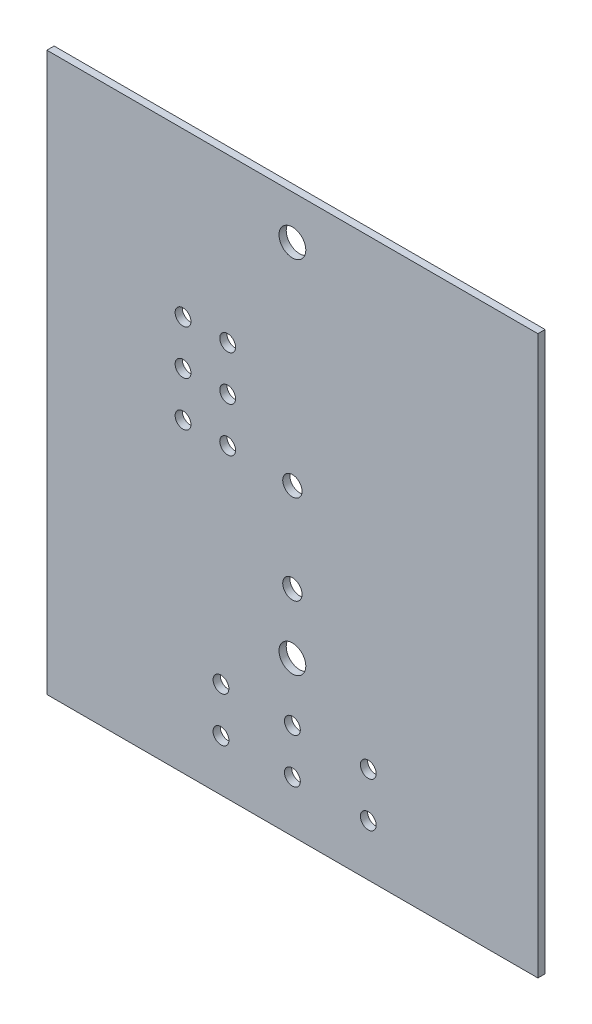
ISO-10303-21;
HEADER;
FILE_DESCRIPTION(('STEP AP214'),'2;1');
FILE_NAME('part.step','',(''),(''),'','','');
FILE_SCHEMA(('AUTOMOTIVE_DESIGN { 1 0 10303 214 1 1 1 1 }'));
ENDSEC;
DATA;
#1=APPLICATION_CONTEXT('core data for automotive mechanical design processes');
#2=APPLICATION_PROTOCOL_DEFINITION('international standard','automotive_design',2000,#1);
#3=PRODUCT_CONTEXT('',#1,'mechanical');
#4=PRODUCT('Part','Part','',(#3));
#5=PRODUCT_RELATED_PRODUCT_CATEGORY('part','',(#4));
#6=PRODUCT_DEFINITION_FORMATION('','',#4);
#7=PRODUCT_DEFINITION_CONTEXT('part definition',#1,'design');
#8=PRODUCT_DEFINITION('design','',#6,#7);
#9=PRODUCT_DEFINITION_SHAPE('','',#8);
#10=(LENGTH_UNIT() NAMED_UNIT(*) SI_UNIT(.MILLI.,.METRE.));
#11=(NAMED_UNIT(*) PLANE_ANGLE_UNIT() SI_UNIT($,.RADIAN.));
#12=(NAMED_UNIT(*) SI_UNIT($,.STERADIAN.) SOLID_ANGLE_UNIT());
#13=UNCERTAINTY_MEASURE_WITH_UNIT(LENGTH_MEASURE(1.E-05),#10,'distance_accuracy_value','');
#14=(GEOMETRIC_REPRESENTATION_CONTEXT(3) GLOBAL_UNCERTAINTY_ASSIGNED_CONTEXT((#13)) GLOBAL_UNIT_ASSIGNED_CONTEXT((#10,
#11,#12)) REPRESENTATION_CONTEXT('',''));
#15=CARTESIAN_POINT('',(0.,0.,0.));
#16=DIRECTION('',(0.,0.,1.));
#17=DIRECTION('',(1.,0.,0.));
#18=AXIS2_PLACEMENT_3D('',#15,#16,#17);
#19=CARTESIAN_POINT('',(0.,31.75,0.));
#20=DIRECTION('',(0.,0.,1.));
#21=DIRECTION('',(1.,0.,0.));
#22=AXIS2_PLACEMENT_3D('',#19,#20,#21);
#23=PLANE('',#22);
#24=CARTESIAN_POINT('',(13.97,29.2608,0.));
#25=DIRECTION('',(0.,0.,-1.));
#26=DIRECTION('',(-1.,0.,0.));
#27=AXIS2_PLACEMENT_3D('',#24,#25,#26);
#28=CIRCLE('',#27,0.762);
#29=CARTESIAN_POINT('',(13.208,29.2608,0.));
#30=VERTEX_POINT('',#29);
#31=EDGE_CURVE('E127',#30,#30,#28,.T.);
#32=ORIENTED_EDGE('',*,*,#31,.T.);
#33=EDGE_LOOP('',(#32));
#34=FACE_BOUND('',#33,.T.);
#35=CARTESIAN_POINT('',(13.97,8.763,0.));
#36=DIRECTION('',(0.,0.,-1.));
#37=DIRECTION('',(-1.,0.,0.));
#38=AXIS2_PLACEMENT_3D('',#35,#36,#37);
#39=CIRCLE('',#38,0.762);
#40=CARTESIAN_POINT('',(13.208,8.763,0.));
#41=VERTEX_POINT('',#40);
#42=EDGE_CURVE('E130',#41,#41,#39,.T.);
#43=ORIENTED_EDGE('',*,*,#42,.T.);
#44=EDGE_LOOP('',(#43));
#45=FACE_BOUND('',#44,.T.);
#46=CARTESIAN_POINT('',(13.97,17.272,0.));
#47=DIRECTION('',(0.,0.,-1.));
#48=DIRECTION('',(-1.,0.,0.));
#49=AXIS2_PLACEMENT_3D('',#46,#47,#48);
#50=CIRCLE('',#49,0.5499989);
#51=CARTESIAN_POINT('',(13.4200011,17.272,0.));
#52=VERTEX_POINT('',#51);
#53=EDGE_CURVE('E133',#52,#52,#50,.T.);
#54=ORIENTED_EDGE('',*,*,#53,.T.);
#55=EDGE_LOOP('',(#54));
#56=FACE_BOUND('',#55,.T.);
#57=CARTESIAN_POINT('',(13.97,12.192,0.));
#58=DIRECTION('',(0.,0.,-1.));
#59=DIRECTION('',(-1.,0.,0.));
#60=AXIS2_PLACEMENT_3D('',#57,#58,#59);
#61=CIRCLE('',#60,0.5499989);
#62=CARTESIAN_POINT('',(13.4200011,12.192,0.));
#63=VERTEX_POINT('',#62);
#64=EDGE_CURVE('E136',#63,#63,#61,.T.);
#65=ORIENTED_EDGE('',*,*,#64,.T.);
#66=EDGE_LOOP('',(#65));
#67=FACE_BOUND('',#66,.T.);
#68=CARTESIAN_POINT('',(18.288,5.461,0.));
#69=DIRECTION('',(0.,0.,-1.));
#70=DIRECTION('',(-1.,0.,0.));
#71=AXIS2_PLACEMENT_3D('',#68,#69,#70);
#72=CIRCLE('',#71,0.4499991);
#73=CARTESIAN_POINT('',(17.8380009,5.461,0.));
#74=VERTEX_POINT('',#73);
#75=EDGE_CURVE('E139',#74,#74,#72,.T.);
#76=ORIENTED_EDGE('',*,*,#75,.T.);
#77=EDGE_LOOP('',(#76));
#78=FACE_BOUND('',#77,.T.);
#79=CARTESIAN_POINT('',(18.288,2.921,0.));
#80=DIRECTION('',(0.,0.,-1.));
#81=DIRECTION('',(-1.,0.,0.));
#82=AXIS2_PLACEMENT_3D('',#79,#80,#81);
#83=CIRCLE('',#82,0.4499991);
#84=CARTESIAN_POINT('',(17.8380009,2.921,0.));
#85=VERTEX_POINT('',#84);
#86=EDGE_CURVE('E142',#85,#85,#83,.T.);
#87=ORIENTED_EDGE('',*,*,#86,.T.);
#88=EDGE_LOOP('',(#87));
#89=FACE_BOUND('',#88,.T.);
#90=CARTESIAN_POINT('',(13.97,5.461,0.));
#91=DIRECTION('',(0.,0.,-1.));
#92=DIRECTION('',(-1.,0.,0.));
#93=AXIS2_PLACEMENT_3D('',#90,#91,#92);
#94=CIRCLE('',#93,0.4499991);
#95=CARTESIAN_POINT('',(13.5200009,5.461,0.));
#96=VERTEX_POINT('',#95);
#97=EDGE_CURVE('E145',#96,#96,#94,.T.);
#98=ORIENTED_EDGE('',*,*,#97,.T.);
#99=EDGE_LOOP('',(#98));
#100=FACE_BOUND('',#99,.T.);
#101=CARTESIAN_POINT('',(13.97,2.921,0.));
#102=DIRECTION('',(0.,0.,-1.));
#103=DIRECTION('',(-1.,0.,0.));
#104=AXIS2_PLACEMENT_3D('',#101,#102,#103);
#105=CIRCLE('',#104,0.4499991);
#106=CARTESIAN_POINT('',(13.5200009,2.921,0.));
#107=VERTEX_POINT('',#106);
#108=EDGE_CURVE('E148',#107,#107,#105,.T.);
#109=ORIENTED_EDGE('',*,*,#108,.T.);
#110=EDGE_LOOP('',(#109));
#111=FACE_BOUND('',#110,.T.);
#112=CARTESIAN_POINT('',(10.287,22.479,0.));
#113=DIRECTION('',(0.,0.,-1.));
#114=DIRECTION('',(-1.,0.,0.));
#115=AXIS2_PLACEMENT_3D('',#112,#113,#114);
#116=CIRCLE('',#115,0.4499991);
#117=CARTESIAN_POINT('',(9.8370009,22.479,0.));
#118=VERTEX_POINT('',#117);
#119=EDGE_CURVE('E151',#118,#118,#116,.T.);
#120=ORIENTED_EDGE('',*,*,#119,.T.);
#121=EDGE_LOOP('',(#120));
#122=FACE_BOUND('',#121,.T.);
#123=CARTESIAN_POINT('',(10.287,19.939,0.));
#124=DIRECTION('',(0.,0.,-1.));
#125=DIRECTION('',(-1.,0.,0.));
#126=AXIS2_PLACEMENT_3D('',#123,#124,#125);
#127=CIRCLE('',#126,0.4499991);
#128=CARTESIAN_POINT('',(9.8370009,19.939,0.));
#129=VERTEX_POINT('',#128);
#130=EDGE_CURVE('E154',#129,#129,#127,.T.);
#131=ORIENTED_EDGE('',*,*,#130,.T.);
#132=EDGE_LOOP('',(#131));
#133=FACE_BOUND('',#132,.T.);
#134=CARTESIAN_POINT('',(7.747,22.479,0.));
#135=DIRECTION('',(0.,0.,-1.));
#136=DIRECTION('',(-1.,0.,0.));
#137=AXIS2_PLACEMENT_3D('',#134,#135,#136);
#138=CIRCLE('',#137,0.4499991);
#139=CARTESIAN_POINT('',(7.2970009,22.479,0.));
#140=VERTEX_POINT('',#139);
#141=EDGE_CURVE('E157',#140,#140,#138,.T.);
#142=ORIENTED_EDGE('',*,*,#141,.T.);
#143=EDGE_LOOP('',(#142));
#144=FACE_BOUND('',#143,.T.);
#145=CARTESIAN_POINT('',(7.747,19.939,0.));
#146=DIRECTION('',(0.,0.,-1.));
#147=DIRECTION('',(-1.,0.,0.));
#148=AXIS2_PLACEMENT_3D('',#145,#146,#147);
#149=CIRCLE('',#148,0.4499991);
#150=CARTESIAN_POINT('',(7.2970009,19.939,0.));
#151=VERTEX_POINT('',#150);
#152=EDGE_CURVE('E160',#151,#151,#149,.T.);
#153=ORIENTED_EDGE('',*,*,#152,.T.);
#154=EDGE_LOOP('',(#153));
#155=FACE_BOUND('',#154,.T.);
#156=CARTESIAN_POINT('',(10.287,17.399,0.));
#157=DIRECTION('',(0.,0.,-1.));
#158=DIRECTION('',(-1.,0.,0.));
#159=AXIS2_PLACEMENT_3D('',#156,#157,#158);
#160=CIRCLE('',#159,0.4499991);
#161=CARTESIAN_POINT('',(9.8370009,17.399,0.));
#162=VERTEX_POINT('',#161);
#163=EDGE_CURVE('E163',#162,#162,#160,.T.);
#164=ORIENTED_EDGE('',*,*,#163,.T.);
#165=EDGE_LOOP('',(#164));
#166=FACE_BOUND('',#165,.T.);
#167=CARTESIAN_POINT('',(9.906,5.461,0.));
#168=DIRECTION('',(0.,0.,-1.));
#169=DIRECTION('',(-1.,0.,0.));
#170=AXIS2_PLACEMENT_3D('',#167,#168,#169);
#171=CIRCLE('',#170,0.4499991);
#172=CARTESIAN_POINT('',(9.4560009,5.461,0.));
#173=VERTEX_POINT('',#172);
#174=EDGE_CURVE('E166',#173,#173,#171,.T.);
#175=ORIENTED_EDGE('',*,*,#174,.T.);
#176=EDGE_LOOP('',(#175));
#177=FACE_BOUND('',#176,.T.);
#178=CARTESIAN_POINT('',(7.747,17.399,0.));
#179=DIRECTION('',(0.,0.,-1.));
#180=DIRECTION('',(-1.,0.,0.));
#181=AXIS2_PLACEMENT_3D('',#178,#179,#180);
#182=CIRCLE('',#181,0.4499991);
#183=CARTESIAN_POINT('',(7.2970009,17.399,0.));
#184=VERTEX_POINT('',#183);
#185=EDGE_CURVE('E168',#184,#184,#182,.T.);
#186=ORIENTED_EDGE('',*,*,#185,.T.);
#187=EDGE_LOOP('',(#186));
#188=FACE_BOUND('',#187,.T.);
#189=CARTESIAN_POINT('',(9.906,2.921,0.));
#190=DIRECTION('',(0.,0.,-1.));
#191=DIRECTION('',(-1.,0.,0.));
#192=AXIS2_PLACEMENT_3D('',#189,#190,#191);
#193=CIRCLE('',#192,0.4499991);
#194=CARTESIAN_POINT('',(9.4560009,2.921,0.));
#195=VERTEX_POINT('',#194);
#196=EDGE_CURVE('E19',#195,#195,#193,.T.);
#197=ORIENTED_EDGE('',*,*,#196,.T.);
#198=EDGE_LOOP('',(#197));
#199=FACE_BOUND('',#198,.T.);
#200=DIRECTION('',(0.,1.,0.));
#201=VECTOR('',#200,1.);
#202=CARTESIAN_POINT('',(27.940000534058,31.75,0.));
#203=LINE('',#202,#201);
#204=CARTESIAN_POINT('',(27.940000534058,31.75,0.));
#205=VERTEX_POINT('',#204);
#206=CARTESIAN_POINT('',(27.940000534058,0.,0.));
#207=VERTEX_POINT('',#206);
#208=EDGE_CURVE('E53',#205,#207,#203,.F.);
#209=ORIENTED_EDGE('',*,*,#208,.F.);
#210=DIRECTION('',(1.,0.,0.));
#211=VECTOR('',#210,1.);
#212=CARTESIAN_POINT('',(0.,31.75,0.));
#213=LINE('',#212,#211);
#214=CARTESIAN_POINT('',(0.,31.75,0.));
#215=VERTEX_POINT('',#214);
#216=EDGE_CURVE('E70',#215,#205,#213,.T.);
#217=ORIENTED_EDGE('',*,*,#216,.F.);
#218=DIRECTION('',(0.,1.,0.));
#219=VECTOR('',#218,1.);
#220=CARTESIAN_POINT('',(0.,0.,0.));
#221=LINE('',#220,#219);
#222=CARTESIAN_POINT('',(0.,0.,0.));
#223=VERTEX_POINT('',#222);
#224=EDGE_CURVE('E67',#223,#215,#221,.T.);
#225=ORIENTED_EDGE('',*,*,#224,.F.);
#226=DIRECTION('',(1.,0.,0.));
#227=VECTOR('',#226,1.);
#228=CARTESIAN_POINT('',(27.940000534058,0.,0.));
#229=LINE('',#228,#227);
#230=EDGE_CURVE('E58',#207,#223,#229,.F.);
#231=ORIENTED_EDGE('',*,*,#230,.F.);
#232=EDGE_LOOP('',(#209,#217,#225,#231));
#233=FACE_BOUND('',#232,.T.);
#234=ADVANCED_FACE('F16',(#34,#45,#56,#67,#78,#89,#100,#111,#122,#133,#144,#155,#166,#177,#188,
#199,#233),#23,.T.);
#235=CARTESIAN_POINT('',(0.,0.,-0.41148));
#236=DIRECTION('',(-1.,0.,0.));
#237=DIRECTION('',(0.,0.,1.));
#238=AXIS2_PLACEMENT_3D('',#235,#236,#237);
#239=PLANE('',#238);
#240=DIRECTION('',(0.,0.,1.));
#241=VECTOR('',#240,1.);
#242=CARTESIAN_POINT('',(0.,31.75,-0.41148));
#243=LINE('',#242,#241);
#244=CARTESIAN_POINT('',(0.,31.75,-0.41148));
#245=VERTEX_POINT('',#244);
#246=EDGE_CURVE('E176',#245,#215,#243,.T.);
#247=ORIENTED_EDGE('',*,*,#246,.F.);
#248=DIRECTION('',(0.,1.,0.));
#249=VECTOR('',#248,1.);
#250=CARTESIAN_POINT('',(0.,31.75,-0.41148));
#251=LINE('',#250,#249);
#252=CARTESIAN_POINT('',(0.,0.,-0.41148));
#253=VERTEX_POINT('',#252);
#254=EDGE_CURVE('E77',#245,#253,#251,.F.);
#255=ORIENTED_EDGE('',*,*,#254,.T.);
#256=DIRECTION('',(0.,0.,-1.));
#257=VECTOR('',#256,1.);
#258=CARTESIAN_POINT('',(0.,0.,-0.41148));
#259=LINE('',#258,#257);
#260=EDGE_CURVE('E63',#223,#253,#259,.T.);
#261=ORIENTED_EDGE('',*,*,#260,.F.);
#262=ORIENTED_EDGE('',*,*,#224,.T.);
#263=EDGE_LOOP('',(#247,#255,#261,#262));
#264=FACE_BOUND('',#263,.T.);
#265=ADVANCED_FACE('F76',(#264),#239,.T.);
#266=CARTESIAN_POINT('',(27.940000534058,0.,-0.41148));
#267=DIRECTION('',(0.,-1.,0.));
#268=DIRECTION('',(0.,0.,-1.));
#269=AXIS2_PLACEMENT_3D('',#266,#267,#268);
#270=PLANE('',#269);
#271=ORIENTED_EDGE('',*,*,#260,.T.);
#272=DIRECTION('',(1.,0.,0.));
#273=VECTOR('',#272,1.);
#274=CARTESIAN_POINT('',(0.,0.,-0.41148));
#275=LINE('',#274,#273);
#276=CARTESIAN_POINT('',(27.940000534058,0.,-0.41148));
#277=VERTEX_POINT('',#276);
#278=EDGE_CURVE('E187',#253,#277,#275,.T.);
#279=ORIENTED_EDGE('',*,*,#278,.T.);
#280=DIRECTION('',(0.,0.,-1.));
#281=VECTOR('',#280,1.);
#282=CARTESIAN_POINT('',(27.940000534058,0.,-0.41148));
#283=LINE('',#282,#281);
#284=EDGE_CURVE('E65',#207,#277,#283,.T.);
#285=ORIENTED_EDGE('',*,*,#284,.F.);
#286=ORIENTED_EDGE('',*,*,#230,.T.);
#287=EDGE_LOOP('',(#271,#279,#285,#286));
#288=FACE_BOUND('',#287,.T.);
#289=ADVANCED_FACE('F60',(#288),#270,.T.);
#290=CARTESIAN_POINT('',(27.940000534058,31.75,-0.41148));
#291=DIRECTION('',(1.,0.,0.));
#292=DIRECTION('',(0.,0.,-1.));
#293=AXIS2_PLACEMENT_3D('',#290,#291,#292);
#294=PLANE('',#293);
#295=ORIENTED_EDGE('',*,*,#284,.T.);
#296=DIRECTION('',(0.,1.,0.));
#297=VECTOR('',#296,1.);
#298=CARTESIAN_POINT('',(27.940000534058,31.75,-0.41148));
#299=LINE('',#298,#297);
#300=CARTESIAN_POINT('',(27.940000534058,31.75,-0.41148));
#301=VERTEX_POINT('',#300);
#302=EDGE_CURVE('E184',#277,#301,#299,.T.);
#303=ORIENTED_EDGE('',*,*,#302,.T.);
#304=DIRECTION('',(0.,0.,1.));
#305=VECTOR('',#304,1.);
#306=CARTESIAN_POINT('',(27.940000534058,31.75,-0.41148));
#307=LINE('',#306,#305);
#308=EDGE_CURVE('E34',#205,#301,#307,.F.);
#309=ORIENTED_EDGE('',*,*,#308,.F.);
#310=ORIENTED_EDGE('',*,*,#208,.T.);
#311=EDGE_LOOP('',(#295,#303,#309,#310));
#312=FACE_BOUND('',#311,.T.);
#313=ADVANCED_FACE('F183',(#312),#294,.T.);
#314=CARTESIAN_POINT('',(0.,31.75,-0.41148));
#315=DIRECTION('',(0.,1.,0.));
#316=DIRECTION('',(0.,0.,1.));
#317=AXIS2_PLACEMENT_3D('',#314,#315,#316);
#318=PLANE('',#317);
#319=ORIENTED_EDGE('',*,*,#308,.T.);
#320=DIRECTION('',(1.,0.,0.));
#321=VECTOR('',#320,1.);
#322=CARTESIAN_POINT('',(0.,31.75,-0.41148));
#323=LINE('',#322,#321);
#324=EDGE_CURVE('E126',#301,#245,#323,.F.);
#325=ORIENTED_EDGE('',*,*,#324,.T.);
#326=ORIENTED_EDGE('',*,*,#246,.T.);
#327=ORIENTED_EDGE('',*,*,#216,.T.);
#328=EDGE_LOOP('',(#319,#325,#326,#327));
#329=FACE_BOUND('',#328,.T.);
#330=ADVANCED_FACE('F190',(#329),#318,.T.);
#331=CARTESIAN_POINT('',(9.906,2.921,-0.41148));
#332=DIRECTION('',(0.,0.,-1.));
#333=DIRECTION('',(-1.,0.,0.));
#334=AXIS2_PLACEMENT_3D('',#331,#332,#333);
#335=CYLINDRICAL_SURFACE('',#334,0.4499991);
#336=ORIENTED_EDGE('',*,*,#196,.F.);
#337=EDGE_LOOP('',(#336));
#338=FACE_BOUND('',#337,.T.);
#339=CARTESIAN_POINT('',(9.906,2.921,-0.41148));
#340=DIRECTION('',(0.,0.,-1.));
#341=DIRECTION('',(-1.,0.,0.));
#342=AXIS2_PLACEMENT_3D('',#339,#340,#341);
#343=CIRCLE('',#342,0.4499991);
#344=CARTESIAN_POINT('',(9.4560009,2.921,-0.41148));
#345=VERTEX_POINT('',#344);
#346=EDGE_CURVE('E123',#345,#345,#343,.T.);
#347=ORIENTED_EDGE('',*,*,#346,.T.);
#348=EDGE_LOOP('',(#347));
#349=FACE_BOUND('',#348,.T.);
#350=ADVANCED_FACE('F192',(#338,#349),#335,.F.);
#351=CARTESIAN_POINT('',(7.747,17.399,-0.41148));
#352=DIRECTION('',(0.,0.,-1.));
#353=DIRECTION('',(-1.,0.,0.));
#354=AXIS2_PLACEMENT_3D('',#351,#352,#353);
#355=CYLINDRICAL_SURFACE('',#354,0.4499991);
#356=ORIENTED_EDGE('',*,*,#185,.F.);
#357=EDGE_LOOP('',(#356));
#358=FACE_BOUND('',#357,.T.);
#359=CARTESIAN_POINT('',(7.747,17.399,-0.41148));
#360=DIRECTION('',(0.,0.,-1.));
#361=DIRECTION('',(-1.,0.,0.));
#362=AXIS2_PLACEMENT_3D('',#359,#360,#361);
#363=CIRCLE('',#362,0.4499991);
#364=CARTESIAN_POINT('',(7.2970009,17.399,-0.41148));
#365=VERTEX_POINT('',#364);
#366=EDGE_CURVE('E120',#365,#365,#363,.T.);
#367=ORIENTED_EDGE('',*,*,#366,.T.);
#368=EDGE_LOOP('',(#367));
#369=FACE_BOUND('',#368,.T.);
#370=ADVANCED_FACE('F199',(#358,#369),#355,.F.);
#371=CARTESIAN_POINT('',(9.906,5.461,-0.41148));
#372=DIRECTION('',(0.,0.,-1.));
#373=DIRECTION('',(-1.,0.,0.));
#374=AXIS2_PLACEMENT_3D('',#371,#372,#373);
#375=CYLINDRICAL_SURFACE('',#374,0.4499991);
#376=ORIENTED_EDGE('',*,*,#174,.F.);
#377=EDGE_LOOP('',(#376));
#378=FACE_BOUND('',#377,.T.);
#379=CARTESIAN_POINT('',(9.906,5.461,-0.41148));
#380=DIRECTION('',(0.,0.,-1.));
#381=DIRECTION('',(-1.,0.,0.));
#382=AXIS2_PLACEMENT_3D('',#379,#380,#381);
#383=CIRCLE('',#382,0.4499991);
#384=CARTESIAN_POINT('',(9.4560009,5.461,-0.41148));
#385=VERTEX_POINT('',#384);
#386=EDGE_CURVE('E117',#385,#385,#383,.T.);
#387=ORIENTED_EDGE('',*,*,#386,.T.);
#388=EDGE_LOOP('',(#387));
#389=FACE_BOUND('',#388,.T.);
#390=ADVANCED_FACE('F262',(#378,#389),#375,.F.);
#391=CARTESIAN_POINT('',(10.287,17.399,-0.41148));
#392=DIRECTION('',(0.,0.,-1.));
#393=DIRECTION('',(-1.,0.,0.));
#394=AXIS2_PLACEMENT_3D('',#391,#392,#393);
#395=CYLINDRICAL_SURFACE('',#394,0.4499991);
#396=ORIENTED_EDGE('',*,*,#163,.F.);
#397=EDGE_LOOP('',(#396));
#398=FACE_BOUND('',#397,.T.);
#399=CARTESIAN_POINT('',(10.287,17.399,-0.41148));
#400=DIRECTION('',(0.,0.,-1.));
#401=DIRECTION('',(-1.,0.,0.));
#402=AXIS2_PLACEMENT_3D('',#399,#400,#401);
#403=CIRCLE('',#402,0.4499991);
#404=CARTESIAN_POINT('',(9.8370009,17.399,-0.41148));
#405=VERTEX_POINT('',#404);
#406=EDGE_CURVE('E114',#405,#405,#403,.T.);
#407=ORIENTED_EDGE('',*,*,#406,.T.);
#408=EDGE_LOOP('',(#407));
#409=FACE_BOUND('',#408,.T.);
#410=ADVANCED_FACE('F258',(#398,#409),#395,.F.);
#411=CARTESIAN_POINT('',(7.747,19.939,-0.41148));
#412=DIRECTION('',(0.,0.,-1.));
#413=DIRECTION('',(-1.,0.,0.));
#414=AXIS2_PLACEMENT_3D('',#411,#412,#413);
#415=CYLINDRICAL_SURFACE('',#414,0.4499991);
#416=ORIENTED_EDGE('',*,*,#152,.F.);
#417=EDGE_LOOP('',(#416));
#418=FACE_BOUND('',#417,.T.);
#419=CARTESIAN_POINT('',(7.747,19.939,-0.41148));
#420=DIRECTION('',(0.,0.,-1.));
#421=DIRECTION('',(-1.,0.,0.));
#422=AXIS2_PLACEMENT_3D('',#419,#420,#421);
#423=CIRCLE('',#422,0.4499991);
#424=CARTESIAN_POINT('',(7.2970009,19.939,-0.41148));
#425=VERTEX_POINT('',#424);
#426=EDGE_CURVE('E111',#425,#425,#423,.T.);
#427=ORIENTED_EDGE('',*,*,#426,.T.);
#428=EDGE_LOOP('',(#427));
#429=FACE_BOUND('',#428,.T.);
#430=ADVANCED_FACE('F254',(#418,#429),#415,.F.);
#431=CARTESIAN_POINT('',(7.747,22.479,-0.41148));
#432=DIRECTION('',(0.,0.,-1.));
#433=DIRECTION('',(-1.,0.,0.));
#434=AXIS2_PLACEMENT_3D('',#431,#432,#433);
#435=CYLINDRICAL_SURFACE('',#434,0.4499991);
#436=ORIENTED_EDGE('',*,*,#141,.F.);
#437=EDGE_LOOP('',(#436));
#438=FACE_BOUND('',#437,.T.);
#439=CARTESIAN_POINT('',(7.747,22.479,-0.41148));
#440=DIRECTION('',(0.,0.,-1.));
#441=DIRECTION('',(-1.,0.,0.));
#442=AXIS2_PLACEMENT_3D('',#439,#440,#441);
#443=CIRCLE('',#442,0.4499991);
#444=CARTESIAN_POINT('',(7.2970009,22.479,-0.41148));
#445=VERTEX_POINT('',#444);
#446=EDGE_CURVE('E108',#445,#445,#443,.T.);
#447=ORIENTED_EDGE('',*,*,#446,.T.);
#448=EDGE_LOOP('',(#447));
#449=FACE_BOUND('',#448,.T.);
#450=ADVANCED_FACE('F250',(#438,#449),#435,.F.);
#451=CARTESIAN_POINT('',(10.287,19.939,-0.41148));
#452=DIRECTION('',(0.,0.,-1.));
#453=DIRECTION('',(-1.,0.,0.));
#454=AXIS2_PLACEMENT_3D('',#451,#452,#453);
#455=CYLINDRICAL_SURFACE('',#454,0.4499991);
#456=ORIENTED_EDGE('',*,*,#130,.F.);
#457=EDGE_LOOP('',(#456));
#458=FACE_BOUND('',#457,.T.);
#459=CARTESIAN_POINT('',(10.287,19.939,-0.41148));
#460=DIRECTION('',(0.,0.,-1.));
#461=DIRECTION('',(-1.,0.,0.));
#462=AXIS2_PLACEMENT_3D('',#459,#460,#461);
#463=CIRCLE('',#462,0.4499991);
#464=CARTESIAN_POINT('',(9.8370009,19.939,-0.41148));
#465=VERTEX_POINT('',#464);
#466=EDGE_CURVE('E105',#465,#465,#463,.T.);
#467=ORIENTED_EDGE('',*,*,#466,.T.);
#468=EDGE_LOOP('',(#467));
#469=FACE_BOUND('',#468,.T.);
#470=ADVANCED_FACE('F246',(#458,#469),#455,.F.);
#471=CARTESIAN_POINT('',(10.287,22.479,-0.41148));
#472=DIRECTION('',(0.,0.,-1.));
#473=DIRECTION('',(-1.,0.,0.));
#474=AXIS2_PLACEMENT_3D('',#471,#472,#473);
#475=CYLINDRICAL_SURFACE('',#474,0.4499991);
#476=ORIENTED_EDGE('',*,*,#119,.F.);
#477=EDGE_LOOP('',(#476));
#478=FACE_BOUND('',#477,.T.);
#479=CARTESIAN_POINT('',(10.287,22.479,-0.41148));
#480=DIRECTION('',(0.,0.,-1.));
#481=DIRECTION('',(-1.,0.,0.));
#482=AXIS2_PLACEMENT_3D('',#479,#480,#481);
#483=CIRCLE('',#482,0.4499991);
#484=CARTESIAN_POINT('',(9.8370009,22.479,-0.41148));
#485=VERTEX_POINT('',#484);
#486=EDGE_CURVE('E102',#485,#485,#483,.T.);
#487=ORIENTED_EDGE('',*,*,#486,.T.);
#488=EDGE_LOOP('',(#487));
#489=FACE_BOUND('',#488,.T.);
#490=ADVANCED_FACE('F242',(#478,#489),#475,.F.);
#491=CARTESIAN_POINT('',(13.97,2.921,-0.41148));
#492=DIRECTION('',(0.,0.,-1.));
#493=DIRECTION('',(-1.,0.,0.));
#494=AXIS2_PLACEMENT_3D('',#491,#492,#493);
#495=CYLINDRICAL_SURFACE('',#494,0.4499991);
#496=ORIENTED_EDGE('',*,*,#108,.F.);
#497=EDGE_LOOP('',(#496));
#498=FACE_BOUND('',#497,.T.);
#499=CARTESIAN_POINT('',(13.97,2.921,-0.41148));
#500=DIRECTION('',(0.,0.,-1.));
#501=DIRECTION('',(-1.,0.,0.));
#502=AXIS2_PLACEMENT_3D('',#499,#500,#501);
#503=CIRCLE('',#502,0.4499991);
#504=CARTESIAN_POINT('',(13.5200009,2.921,-0.41148));
#505=VERTEX_POINT('',#504);
#506=EDGE_CURVE('E99',#505,#505,#503,.T.);
#507=ORIENTED_EDGE('',*,*,#506,.T.);
#508=EDGE_LOOP('',(#507));
#509=FACE_BOUND('',#508,.T.);
#510=ADVANCED_FACE('F238',(#498,#509),#495,.F.);
#511=CARTESIAN_POINT('',(13.97,5.461,-0.41148));
#512=DIRECTION('',(0.,0.,-1.));
#513=DIRECTION('',(-1.,0.,0.));
#514=AXIS2_PLACEMENT_3D('',#511,#512,#513);
#515=CYLINDRICAL_SURFACE('',#514,0.4499991);
#516=ORIENTED_EDGE('',*,*,#97,.F.);
#517=EDGE_LOOP('',(#516));
#518=FACE_BOUND('',#517,.T.);
#519=CARTESIAN_POINT('',(13.97,5.461,-0.41148));
#520=DIRECTION('',(0.,0.,-1.));
#521=DIRECTION('',(-1.,0.,0.));
#522=AXIS2_PLACEMENT_3D('',#519,#520,#521);
#523=CIRCLE('',#522,0.4499991);
#524=CARTESIAN_POINT('',(13.5200009,5.461,-0.41148));
#525=VERTEX_POINT('',#524);
#526=EDGE_CURVE('E96',#525,#525,#523,.T.);
#527=ORIENTED_EDGE('',*,*,#526,.T.);
#528=EDGE_LOOP('',(#527));
#529=FACE_BOUND('',#528,.T.);
#530=ADVANCED_FACE('F234',(#518,#529),#515,.F.);
#531=CARTESIAN_POINT('',(18.288,2.921,-0.41148));
#532=DIRECTION('',(0.,0.,-1.));
#533=DIRECTION('',(-1.,0.,0.));
#534=AXIS2_PLACEMENT_3D('',#531,#532,#533);
#535=CYLINDRICAL_SURFACE('',#534,0.4499991);
#536=ORIENTED_EDGE('',*,*,#86,.F.);
#537=EDGE_LOOP('',(#536));
#538=FACE_BOUND('',#537,.T.);
#539=CARTESIAN_POINT('',(18.288,2.921,-0.41148));
#540=DIRECTION('',(0.,0.,-1.));
#541=DIRECTION('',(-1.,0.,0.));
#542=AXIS2_PLACEMENT_3D('',#539,#540,#541);
#543=CIRCLE('',#542,0.4499991);
#544=CARTESIAN_POINT('',(17.8380009,2.921,-0.41148));
#545=VERTEX_POINT('',#544);
#546=EDGE_CURVE('E93',#545,#545,#543,.T.);
#547=ORIENTED_EDGE('',*,*,#546,.T.);
#548=EDGE_LOOP('',(#547));
#549=FACE_BOUND('',#548,.T.);
#550=ADVANCED_FACE('F230',(#538,#549),#535,.F.);
#551=CARTESIAN_POINT('',(18.288,5.461,-0.41148));
#552=DIRECTION('',(0.,0.,-1.));
#553=DIRECTION('',(-1.,0.,0.));
#554=AXIS2_PLACEMENT_3D('',#551,#552,#553);
#555=CYLINDRICAL_SURFACE('',#554,0.4499991);
#556=ORIENTED_EDGE('',*,*,#75,.F.);
#557=EDGE_LOOP('',(#556));
#558=FACE_BOUND('',#557,.T.);
#559=CARTESIAN_POINT('',(18.288,5.461,-0.41148));
#560=DIRECTION('',(0.,0.,-1.));
#561=DIRECTION('',(-1.,0.,0.));
#562=AXIS2_PLACEMENT_3D('',#559,#560,#561);
#563=CIRCLE('',#562,0.4499991);
#564=CARTESIAN_POINT('',(17.8380009,5.461,-0.41148));
#565=VERTEX_POINT('',#564);
#566=EDGE_CURVE('E90',#565,#565,#563,.T.);
#567=ORIENTED_EDGE('',*,*,#566,.T.);
#568=EDGE_LOOP('',(#567));
#569=FACE_BOUND('',#568,.T.);
#570=ADVANCED_FACE('F226',(#558,#569),#555,.F.);
#571=CARTESIAN_POINT('',(13.97,12.192,-0.41148));
#572=DIRECTION('',(0.,0.,-1.));
#573=DIRECTION('',(-1.,0.,0.));
#574=AXIS2_PLACEMENT_3D('',#571,#572,#573);
#575=CYLINDRICAL_SURFACE('',#574,0.5499989);
#576=ORIENTED_EDGE('',*,*,#64,.F.);
#577=EDGE_LOOP('',(#576));
#578=FACE_BOUND('',#577,.T.);
#579=CARTESIAN_POINT('',(13.97,12.192,-0.41148));
#580=DIRECTION('',(0.,0.,-1.));
#581=DIRECTION('',(-1.,0.,0.));
#582=AXIS2_PLACEMENT_3D('',#579,#580,#581);
#583=CIRCLE('',#582,0.5499989);
#584=CARTESIAN_POINT('',(13.4200011,12.192,-0.41148));
#585=VERTEX_POINT('',#584);
#586=EDGE_CURVE('E87',#585,#585,#583,.T.);
#587=ORIENTED_EDGE('',*,*,#586,.T.);
#588=EDGE_LOOP('',(#587));
#589=FACE_BOUND('',#588,.T.);
#590=ADVANCED_FACE('F222',(#578,#589),#575,.F.);
#591=CARTESIAN_POINT('',(13.97,17.272,-0.41148));
#592=DIRECTION('',(0.,0.,-1.));
#593=DIRECTION('',(-1.,0.,0.));
#594=AXIS2_PLACEMENT_3D('',#591,#592,#593);
#595=CYLINDRICAL_SURFACE('',#594,0.5499989);
#596=ORIENTED_EDGE('',*,*,#53,.F.);
#597=EDGE_LOOP('',(#596));
#598=FACE_BOUND('',#597,.T.);
#599=CARTESIAN_POINT('',(13.97,17.272,-0.41148));
#600=DIRECTION('',(0.,0.,-1.));
#601=DIRECTION('',(-1.,0.,0.));
#602=AXIS2_PLACEMENT_3D('',#599,#600,#601);
#603=CIRCLE('',#602,0.5499989);
#604=CARTESIAN_POINT('',(13.4200011,17.272,-0.41148));
#605=VERTEX_POINT('',#604);
#606=EDGE_CURVE('E84',#605,#605,#603,.T.);
#607=ORIENTED_EDGE('',*,*,#606,.T.);
#608=EDGE_LOOP('',(#607));
#609=FACE_BOUND('',#608,.T.);
#610=ADVANCED_FACE('F218',(#598,#609),#595,.F.);
#611=CARTESIAN_POINT('',(13.97,8.763,-0.41148));
#612=DIRECTION('',(0.,0.,-1.));
#613=DIRECTION('',(-1.,0.,0.));
#614=AXIS2_PLACEMENT_3D('',#611,#612,#613);
#615=CYLINDRICAL_SURFACE('',#614,0.762);
#616=ORIENTED_EDGE('',*,*,#42,.F.);
#617=EDGE_LOOP('',(#616));
#618=FACE_BOUND('',#617,.T.);
#619=CARTESIAN_POINT('',(13.97,8.763,-0.41148));
#620=DIRECTION('',(0.,0.,-1.));
#621=DIRECTION('',(-1.,0.,0.));
#622=AXIS2_PLACEMENT_3D('',#619,#620,#621);
#623=CIRCLE('',#622,0.762);
#624=CARTESIAN_POINT('',(13.208,8.763,-0.41148));
#625=VERTEX_POINT('',#624);
#626=EDGE_CURVE('E25',#625,#625,#623,.T.);
#627=ORIENTED_EDGE('',*,*,#626,.T.);
#628=EDGE_LOOP('',(#627));
#629=FACE_BOUND('',#628,.T.);
#630=ADVANCED_FACE('F210',(#618,#629),#615,.F.);
#631=CARTESIAN_POINT('',(13.97,29.2608,-0.41148));
#632=DIRECTION('',(0.,0.,-1.));
#633=DIRECTION('',(-1.,0.,0.));
#634=AXIS2_PLACEMENT_3D('',#631,#632,#633);
#635=CYLINDRICAL_SURFACE('',#634,0.762);
#636=ORIENTED_EDGE('',*,*,#31,.F.);
#637=EDGE_LOOP('',(#636));
#638=FACE_BOUND('',#637,.T.);
#639=CARTESIAN_POINT('',(13.97,29.2608,-0.41148));
#640=DIRECTION('',(0.,0.,-1.));
#641=DIRECTION('',(-1.,0.,0.));
#642=AXIS2_PLACEMENT_3D('',#639,#640,#641);
#643=CIRCLE('',#642,0.762);
#644=CARTESIAN_POINT('',(13.208,29.2608,-0.41148));
#645=VERTEX_POINT('',#644);
#646=EDGE_CURVE('E11',#645,#645,#643,.T.);
#647=ORIENTED_EDGE('',*,*,#646,.T.);
#648=EDGE_LOOP('',(#647));
#649=FACE_BOUND('',#648,.T.);
#650=ADVANCED_FACE('F204',(#638,#649),#635,.F.);
#651=CARTESIAN_POINT('',(0.,31.75,-0.41148));
#652=DIRECTION('',(0.,0.,1.));
#653=DIRECTION('',(1.,0.,0.));
#654=AXIS2_PLACEMENT_3D('',#651,#652,#653);
#655=PLANE('',#654);
#656=ORIENTED_EDGE('',*,*,#646,.F.);
#657=EDGE_LOOP('',(#656));
#658=FACE_BOUND('',#657,.T.);
#659=ORIENTED_EDGE('',*,*,#626,.F.);
#660=EDGE_LOOP('',(#659));
#661=FACE_BOUND('',#660,.T.);
#662=ORIENTED_EDGE('',*,*,#606,.F.);
#663=EDGE_LOOP('',(#662));
#664=FACE_BOUND('',#663,.T.);
#665=ORIENTED_EDGE('',*,*,#586,.F.);
#666=EDGE_LOOP('',(#665));
#667=FACE_BOUND('',#666,.T.);
#668=ORIENTED_EDGE('',*,*,#566,.F.);
#669=EDGE_LOOP('',(#668));
#670=FACE_BOUND('',#669,.T.);
#671=ORIENTED_EDGE('',*,*,#546,.F.);
#672=EDGE_LOOP('',(#671));
#673=FACE_BOUND('',#672,.T.);
#674=ORIENTED_EDGE('',*,*,#526,.F.);
#675=EDGE_LOOP('',(#674));
#676=FACE_BOUND('',#675,.T.);
#677=ORIENTED_EDGE('',*,*,#506,.F.);
#678=EDGE_LOOP('',(#677));
#679=FACE_BOUND('',#678,.T.);
#680=ORIENTED_EDGE('',*,*,#486,.F.);
#681=EDGE_LOOP('',(#680));
#682=FACE_BOUND('',#681,.T.);
#683=ORIENTED_EDGE('',*,*,#466,.F.);
#684=EDGE_LOOP('',(#683));
#685=FACE_BOUND('',#684,.T.);
#686=ORIENTED_EDGE('',*,*,#446,.F.);
#687=EDGE_LOOP('',(#686));
#688=FACE_BOUND('',#687,.T.);
#689=ORIENTED_EDGE('',*,*,#426,.F.);
#690=EDGE_LOOP('',(#689));
#691=FACE_BOUND('',#690,.T.);
#692=ORIENTED_EDGE('',*,*,#406,.F.);
#693=EDGE_LOOP('',(#692));
#694=FACE_BOUND('',#693,.T.);
#695=ORIENTED_EDGE('',*,*,#386,.F.);
#696=EDGE_LOOP('',(#695));
#697=FACE_BOUND('',#696,.T.);
#698=ORIENTED_EDGE('',*,*,#366,.F.);
#699=EDGE_LOOP('',(#698));
#700=FACE_BOUND('',#699,.T.);
#701=ORIENTED_EDGE('',*,*,#346,.F.);
#702=EDGE_LOOP('',(#701));
#703=FACE_BOUND('',#702,.T.);
#704=ORIENTED_EDGE('',*,*,#302,.F.);
#705=ORIENTED_EDGE('',*,*,#278,.F.);
#706=ORIENTED_EDGE('',*,*,#254,.F.);
#707=ORIENTED_EDGE('',*,*,#324,.F.);
#708=EDGE_LOOP('',(#704,#705,#706,#707));
#709=FACE_BOUND('',#708,.T.);
#710=ADVANCED_FACE('F186',(#658,#661,#664,#667,#670,#673,#676,#679,#682,#685,#688,#691,#694,
#697,#700,#703,#709),#655,.F.);
#711=CLOSED_SHELL('',(#234,#265,#289,#313,#330,#350,#370,#390,#410,#430,#450,#470,#490,#510,
#530,#550,#570,#590,#610,#630,#650,#710));
#712=MANIFOLD_SOLID_BREP('B1',#711);
#713=ADVANCED_BREP_SHAPE_REPRESENTATION('',(#18,#712),#14);
#714=SHAPE_DEFINITION_REPRESENTATION(#9,#713);
ENDSEC;
END-ISO-10303-21;
